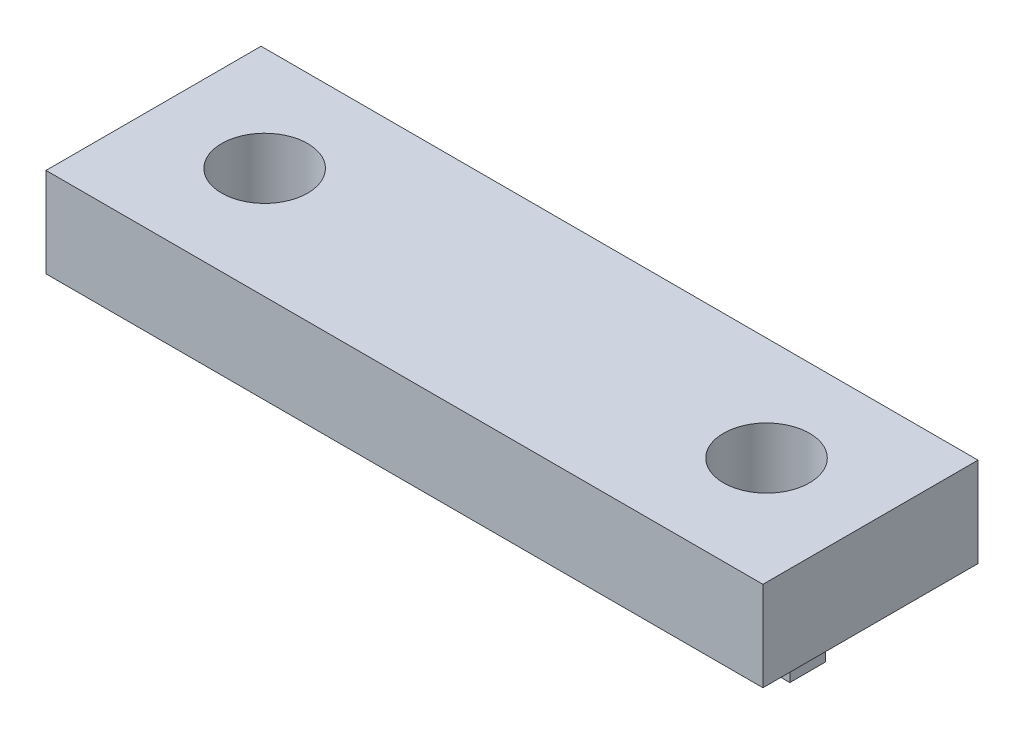
ISO-10303-21;
HEADER;
FILE_DESCRIPTION(('STEP AP214'),'2;1');
FILE_NAME('part.step','',(''),(''),'','','');
FILE_SCHEMA(('AUTOMOTIVE_DESIGN { 1 0 10303 214 1 1 1 1 }'));
ENDSEC;
DATA;
#1=APPLICATION_CONTEXT('core data for automotive mechanical design processes');
#2=APPLICATION_PROTOCOL_DEFINITION('international standard','automotive_design',2000,#1);
#3=PRODUCT_CONTEXT('',#1,'mechanical');
#4=PRODUCT('Part','Part','',(#3));
#5=PRODUCT_RELATED_PRODUCT_CATEGORY('part','',(#4));
#6=PRODUCT_DEFINITION_FORMATION('','',#4);
#7=PRODUCT_DEFINITION_CONTEXT('part definition',#1,'design');
#8=PRODUCT_DEFINITION('design','',#6,#7);
#9=PRODUCT_DEFINITION_SHAPE('','',#8);
#10=(LENGTH_UNIT() NAMED_UNIT(*) SI_UNIT(.MILLI.,.METRE.));
#11=(NAMED_UNIT(*) PLANE_ANGLE_UNIT() SI_UNIT($,.RADIAN.));
#12=(NAMED_UNIT(*) SI_UNIT($,.STERADIAN.) SOLID_ANGLE_UNIT());
#13=UNCERTAINTY_MEASURE_WITH_UNIT(LENGTH_MEASURE(1.E-05),#10,'distance_accuracy_value','');
#14=(GEOMETRIC_REPRESENTATION_CONTEXT(3) GLOBAL_UNCERTAINTY_ASSIGNED_CONTEXT((#13)) GLOBAL_UNIT_ASSIGNED_CONTEXT((#10,
#11,#12)) REPRESENTATION_CONTEXT('',''));
#15=CARTESIAN_POINT('',(0.,0.,0.));
#16=DIRECTION('',(0.,0.,1.));
#17=DIRECTION('',(1.,0.,0.));
#18=AXIS2_PLACEMENT_3D('',#15,#16,#17);
#19=CARTESIAN_POINT('',(40.,0.,2.));
#20=DIRECTION('',(0.,1.,0.));
#21=DIRECTION('',(0.,0.,1.));
#22=AXIS2_PLACEMENT_3D('',#19,#20,#21);
#23=PLANE('',#22);
#24=DIRECTION('',(-1.,0.,0.));
#25=VECTOR('',#24,1.);
#26=CARTESIAN_POINT('',(40.,0.,0.));
#27=LINE('',#26,#25);
#28=CARTESIAN_POINT('',(31.5,0.,0.));
#29=VERTEX_POINT('',#28);
#30=CARTESIAN_POINT('',(8.5,0.,0.));
#31=VERTEX_POINT('',#30);
#32=EDGE_CURVE('E11',#29,#31,#27,.T.);
#33=ORIENTED_EDGE('',*,*,#32,.F.);
#34=DIRECTION('',(0.,0.,1.));
#35=VECTOR('',#34,1.);
#36=CARTESIAN_POINT('',(31.5,0.,-38.));
#37=LINE('',#36,#35);
#38=CARTESIAN_POINT('',(31.5,0.,2.));
#39=VERTEX_POINT('',#38);
#40=EDGE_CURVE('E114',#29,#39,#37,.T.);
#41=ORIENTED_EDGE('',*,*,#40,.T.);
#42=DIRECTION('',(-1.,0.,0.));
#43=VECTOR('',#42,1.);
#44=CARTESIAN_POINT('',(40.,0.,2.));
#45=LINE('',#44,#43);
#46=CARTESIAN_POINT('',(8.5,0.,2.));
#47=VERTEX_POINT('',#46);
#48=EDGE_CURVE('E122',#39,#47,#45,.T.);
#49=ORIENTED_EDGE('',*,*,#48,.T.);
#50=DIRECTION('',(0.,0.,1.));
#51=VECTOR('',#50,1.);
#52=CARTESIAN_POINT('',(8.5,0.,-38.));
#53=LINE('',#52,#51);
#54=EDGE_CURVE('E203',#31,#47,#53,.T.);
#55=ORIENTED_EDGE('',*,*,#54,.F.);
#56=EDGE_LOOP('',(#33,#41,#49,#55));
#57=FACE_BOUND('',#56,.T.);
#58=ADVANCED_FACE('F33',(#57),#23,.F.);
#59=CARTESIAN_POINT('',(40.,0.,0.));
#60=DIRECTION('',(0.,0.,1.));
#61=DIRECTION('',(1.,0.,0.));
#62=AXIS2_PLACEMENT_3D('',#59,#60,#61);
#63=PLANE('',#62);
#64=CARTESIAN_POINT('',(13.5,5.,0.));
#65=DIRECTION('',(0.,0.,1.));
#66=DIRECTION('',(1.,0.,0.));
#67=AXIS2_PLACEMENT_3D('',#64,#65,#66);
#68=CIRCLE('',#67,2.49999999999999);
#69=CARTESIAN_POINT('',(16.,5.,0.));
#70=VERTEX_POINT('',#69);
#71=EDGE_CURVE('E219',#70,#70,#68,.T.);
#72=ORIENTED_EDGE('',*,*,#71,.T.);
#73=EDGE_LOOP('',(#72));
#74=FACE_BOUND('',#73,.T.);
#75=CARTESIAN_POINT('',(26.5,5.,0.));
#76=DIRECTION('',(0.,0.,1.));
#77=DIRECTION('',(1.,0.,0.));
#78=AXIS2_PLACEMENT_3D('',#75,#76,#77);
#79=CIRCLE('',#78,2.5);
#80=CARTESIAN_POINT('',(29.,5.,0.));
#81=VERTEX_POINT('',#80);
#82=EDGE_CURVE('E123',#81,#81,#79,.T.);
#83=ORIENTED_EDGE('',*,*,#82,.T.);
#84=EDGE_LOOP('',(#83));
#85=FACE_BOUND('',#84,.T.);
#86=DIRECTION('',(-1.,0.,0.));
#87=VECTOR('',#86,1.);
#88=CARTESIAN_POINT('',(40.,9.,0.));
#89=LINE('',#88,#87);
#90=CARTESIAN_POINT('',(40.,9.,0.));
#91=VERTEX_POINT('',#90);
#92=CARTESIAN_POINT('',(31.5,9.,0.));
#93=VERTEX_POINT('',#92);
#94=EDGE_CURVE('E180',#91,#93,#89,.T.);
#95=ORIENTED_EDGE('',*,*,#94,.T.);
#96=DIRECTION('',(0.,-1.,0.));
#97=VECTOR('',#96,1.);
#98=CARTESIAN_POINT('',(31.5,0.,0.));
#99=LINE('',#98,#97);
#100=EDGE_CURVE('E110',#93,#29,#99,.T.);
#101=ORIENTED_EDGE('',*,*,#100,.T.);
#102=ORIENTED_EDGE('',*,*,#32,.T.);
#103=DIRECTION('',(0.,1.,0.));
#104=VECTOR('',#103,1.);
#105=CARTESIAN_POINT('',(8.5,0.,0.));
#106=LINE('',#105,#104);
#107=CARTESIAN_POINT('',(8.5,9.,0.));
#108=VERTEX_POINT('',#107);
#109=EDGE_CURVE('E171',#31,#108,#106,.T.);
#110=ORIENTED_EDGE('',*,*,#109,.T.);
#111=DIRECTION('',(-1.,0.,0.));
#112=VECTOR('',#111,1.);
#113=CARTESIAN_POINT('',(40.,9.,0.));
#114=LINE('',#113,#112);
#115=CARTESIAN_POINT('',(0.,9.,0.));
#116=VERTEX_POINT('',#115);
#117=EDGE_CURVE('E164',#108,#116,#114,.T.);
#118=ORIENTED_EDGE('',*,*,#117,.T.);
#119=DIRECTION('',(0.,1.,0.));
#120=VECTOR('',#119,1.);
#121=CARTESIAN_POINT('',(0.,0.,0.));
#122=LINE('',#121,#120);
#123=CARTESIAN_POINT('',(0.,14.,0.));
#124=VERTEX_POINT('',#123);
#125=EDGE_CURVE('E140',#116,#124,#122,.T.);
#126=ORIENTED_EDGE('',*,*,#125,.T.);
#127=DIRECTION('',(-1.,0.,0.));
#128=VECTOR('',#127,1.);
#129=CARTESIAN_POINT('',(40.,14.,0.));
#130=LINE('',#129,#128);
#131=CARTESIAN_POINT('',(40.,14.,0.));
#132=VERTEX_POINT('',#131);
#133=EDGE_CURVE('E41',#132,#124,#130,.T.);
#134=ORIENTED_EDGE('',*,*,#133,.F.);
#135=DIRECTION('',(0.,1.,0.));
#136=VECTOR('',#135,1.);
#137=CARTESIAN_POINT('',(40.,0.,0.));
#138=LINE('',#137,#136);
#139=EDGE_CURVE('E75',#91,#132,#138,.T.);
#140=ORIENTED_EDGE('',*,*,#139,.F.);
#141=EDGE_LOOP('',(#95,#101,#102,#110,#118,#126,#134,#140));
#142=FACE_BOUND('',#141,.T.);
#143=ADVANCED_FACE('F169',(#74,#85,#142),#63,.F.);
#144=CARTESIAN_POINT('',(40.,14.,0.));
#145=DIRECTION('',(0.,-1.,0.));
#146=DIRECTION('',(0.,0.,-1.));
#147=AXIS2_PLACEMENT_3D('',#144,#145,#146);
#148=PLANE('',#147);
#149=CARTESIAN_POINT('',(6.,14.,5.8));
#150=DIRECTION('',(0.,1.,0.));
#151=DIRECTION('',(0.,0.,1.));
#152=AXIS2_PLACEMENT_3D('',#149,#150,#151);
#153=CIRCLE('',#152,2.4);
#154=CARTESIAN_POINT('',(6.,14.,8.2));
#155=VERTEX_POINT('',#154);
#156=EDGE_CURVE('E151',#155,#155,#153,.T.);
#157=ORIENTED_EDGE('',*,*,#156,.F.);
#158=EDGE_LOOP('',(#157));
#159=FACE_BOUND('',#158,.T.);
#160=CARTESIAN_POINT('',(34.,14.,5.8));
#161=DIRECTION('',(0.,1.,0.));
#162=DIRECTION('',(0.,0.,1.));
#163=AXIS2_PLACEMENT_3D('',#160,#161,#162);
#164=CIRCLE('',#163,2.4);
#165=CARTESIAN_POINT('',(34.,14.,8.2));
#166=VERTEX_POINT('',#165);
#167=EDGE_CURVE('E141',#166,#166,#164,.T.);
#168=ORIENTED_EDGE('',*,*,#167,.F.);
#169=EDGE_LOOP('',(#168));
#170=FACE_BOUND('',#169,.T.);
#171=DIRECTION('',(0.,0.,1.));
#172=VECTOR('',#171,1.);
#173=CARTESIAN_POINT('',(0.,14.,0.));
#174=LINE('',#173,#172);
#175=CARTESIAN_POINT('',(0.,14.,12.));
#176=VERTEX_POINT('',#175);
#177=EDGE_CURVE('E144',#124,#176,#174,.T.);
#178=ORIENTED_EDGE('',*,*,#177,.T.);
#179=DIRECTION('',(-1.,0.,0.));
#180=VECTOR('',#179,1.);
#181=CARTESIAN_POINT('',(40.,14.,12.));
#182=LINE('',#181,#180);
#183=CARTESIAN_POINT('',(40.,14.,12.));
#184=VERTEX_POINT('',#183);
#185=EDGE_CURVE('E131',#184,#176,#182,.T.);
#186=ORIENTED_EDGE('',*,*,#185,.F.);
#187=DIRECTION('',(0.,0.,1.));
#188=VECTOR('',#187,1.);
#189=CARTESIAN_POINT('',(40.,14.,0.));
#190=LINE('',#189,#188);
#191=EDGE_CURVE('E156',#132,#184,#190,.T.);
#192=ORIENTED_EDGE('',*,*,#191,.F.);
#193=ORIENTED_EDGE('',*,*,#133,.T.);
#194=EDGE_LOOP('',(#178,#186,#192,#193));
#195=FACE_BOUND('',#194,.T.);
#196=ADVANCED_FACE('F177',(#159,#170,#195),#148,.F.);
#197=CARTESIAN_POINT('',(40.,14.,12.));
#198=DIRECTION('',(0.,0.,-1.));
#199=DIRECTION('',(0.,1.,0.));
#200=AXIS2_PLACEMENT_3D('',#197,#198,#199);
#201=PLANE('',#200);
#202=DIRECTION('',(0.,-1.,0.));
#203=VECTOR('',#202,1.);
#204=CARTESIAN_POINT('',(0.,14.,12.));
#205=LINE('',#204,#203);
#206=CARTESIAN_POINT('',(0.,9.,12.));
#207=VERTEX_POINT('',#206);
#208=EDGE_CURVE('E72',#176,#207,#205,.T.);
#209=ORIENTED_EDGE('',*,*,#208,.T.);
#210=DIRECTION('',(-1.,0.,0.));
#211=VECTOR('',#210,1.);
#212=CARTESIAN_POINT('',(40.,9.,12.));
#213=LINE('',#212,#211);
#214=CARTESIAN_POINT('',(40.,9.,12.));
#215=VERTEX_POINT('',#214);
#216=EDGE_CURVE('E129',#215,#207,#213,.T.);
#217=ORIENTED_EDGE('',*,*,#216,.F.);
#218=DIRECTION('',(0.,-1.,0.));
#219=VECTOR('',#218,1.);
#220=CARTESIAN_POINT('',(40.,14.,12.));
#221=LINE('',#220,#219);
#222=EDGE_CURVE('E55',#184,#215,#221,.T.);
#223=ORIENTED_EDGE('',*,*,#222,.F.);
#224=ORIENTED_EDGE('',*,*,#185,.T.);
#225=EDGE_LOOP('',(#209,#217,#223,#224));
#226=FACE_BOUND('',#225,.T.);
#227=ADVANCED_FACE('F179',(#226),#201,.F.);
#228=CARTESIAN_POINT('',(40.,9.,12.));
#229=DIRECTION('',(0.,1.,0.));
#230=DIRECTION('',(0.,0.,1.));
#231=AXIS2_PLACEMENT_3D('',#228,#229,#230);
#232=PLANE('',#231);
#233=CARTESIAN_POINT('',(6.,9.,5.8));
#234=DIRECTION('',(0.,1.,0.));
#235=DIRECTION('',(0.,0.,1.));
#236=AXIS2_PLACEMENT_3D('',#233,#234,#235);
#237=CIRCLE('',#236,2.4);
#238=CARTESIAN_POINT('',(6.,9.,8.2));
#239=VERTEX_POINT('',#238);
#240=EDGE_CURVE('E36',#239,#239,#237,.T.);
#241=ORIENTED_EDGE('',*,*,#240,.T.);
#242=EDGE_LOOP('',(#241));
#243=FACE_BOUND('',#242,.T.);
#244=CARTESIAN_POINT('',(34.,9.,5.8));
#245=DIRECTION('',(0.,1.,0.));
#246=DIRECTION('',(0.,0.,1.));
#247=AXIS2_PLACEMENT_3D('',#244,#245,#246);
#248=CIRCLE('',#247,2.4);
#249=CARTESIAN_POINT('',(34.,9.,8.2));
#250=VERTEX_POINT('',#249);
#251=EDGE_CURVE('E138',#250,#250,#248,.T.);
#252=ORIENTED_EDGE('',*,*,#251,.T.);
#253=EDGE_LOOP('',(#252));
#254=FACE_BOUND('',#253,.T.);
#255=DIRECTION('',(0.,0.,-1.));
#256=VECTOR('',#255,1.);
#257=CARTESIAN_POINT('',(0.,9.,12.));
#258=LINE('',#257,#256);
#259=EDGE_CURVE('E157',#207,#116,#258,.T.);
#260=ORIENTED_EDGE('',*,*,#259,.T.);
#261=ORIENTED_EDGE('',*,*,#117,.F.);
#262=DIRECTION('',(0.,0.,1.));
#263=VECTOR('',#262,1.);
#264=CARTESIAN_POINT('',(8.5,9.,-38.));
#265=LINE('',#264,#263);
#266=CARTESIAN_POINT('',(8.5,9.,2.));
#267=VERTEX_POINT('',#266);
#268=EDGE_CURVE('E127',#108,#267,#265,.T.);
#269=ORIENTED_EDGE('',*,*,#268,.T.);
#270=DIRECTION('',(-1.,0.,0.));
#271=VECTOR('',#270,1.);
#272=CARTESIAN_POINT('',(40.,9.,2.));
#273=LINE('',#272,#271);
#274=CARTESIAN_POINT('',(31.5,9.,2.));
#275=VERTEX_POINT('',#274);
#276=EDGE_CURVE('E120',#275,#267,#273,.T.);
#277=ORIENTED_EDGE('',*,*,#276,.F.);
#278=DIRECTION('',(0.,0.,1.));
#279=VECTOR('',#278,1.);
#280=CARTESIAN_POINT('',(31.5,9.,-38.));
#281=LINE('',#280,#279);
#282=EDGE_CURVE('E104',#93,#275,#281,.T.);
#283=ORIENTED_EDGE('',*,*,#282,.F.);
#284=ORIENTED_EDGE('',*,*,#94,.F.);
#285=DIRECTION('',(0.,0.,-1.));
#286=VECTOR('',#285,1.);
#287=CARTESIAN_POINT('',(40.,9.,12.));
#288=LINE('',#287,#286);
#289=EDGE_CURVE('E49',#215,#91,#288,.T.);
#290=ORIENTED_EDGE('',*,*,#289,.F.);
#291=ORIENTED_EDGE('',*,*,#216,.T.);
#292=EDGE_LOOP('',(#260,#261,#269,#277,#283,#284,#290,#291));
#293=FACE_BOUND('',#292,.T.);
#294=ADVANCED_FACE('F125',(#243,#254,#293),#232,.F.);
#295=CARTESIAN_POINT('',(40.,9.,2.));
#296=DIRECTION('',(0.,0.,-1.));
#297=DIRECTION('',(-1.,0.,0.));
#298=AXIS2_PLACEMENT_3D('',#295,#296,#297);
#299=PLANE('',#298);
#300=CARTESIAN_POINT('',(13.5,5.,2.));
#301=DIRECTION('',(0.,0.,1.));
#302=DIRECTION('',(1.,0.,0.));
#303=AXIS2_PLACEMENT_3D('',#300,#301,#302);
#304=CIRCLE('',#303,2.49999999999999);
#305=CARTESIAN_POINT('',(16.,5.,2.));
#306=VERTEX_POINT('',#305);
#307=EDGE_CURVE('E222',#306,#306,#304,.T.);
#308=ORIENTED_EDGE('',*,*,#307,.F.);
#309=EDGE_LOOP('',(#308));
#310=FACE_BOUND('',#309,.T.);
#311=CARTESIAN_POINT('',(26.5,5.,2.));
#312=DIRECTION('',(0.,0.,1.));
#313=DIRECTION('',(1.,0.,0.));
#314=AXIS2_PLACEMENT_3D('',#311,#312,#313);
#315=CIRCLE('',#314,2.5);
#316=CARTESIAN_POINT('',(29.,5.,2.));
#317=VERTEX_POINT('',#316);
#318=EDGE_CURVE('E216',#317,#317,#315,.T.);
#319=ORIENTED_EDGE('',*,*,#318,.F.);
#320=EDGE_LOOP('',(#319));
#321=FACE_BOUND('',#320,.T.);
#322=ORIENTED_EDGE('',*,*,#48,.F.);
#323=DIRECTION('',(0.,-1.,0.));
#324=VECTOR('',#323,1.);
#325=CARTESIAN_POINT('',(31.5,0.,2.));
#326=LINE('',#325,#324);
#327=EDGE_CURVE('E107',#275,#39,#326,.T.);
#328=ORIENTED_EDGE('',*,*,#327,.F.);
#329=ORIENTED_EDGE('',*,*,#276,.T.);
#330=DIRECTION('',(0.,1.,0.));
#331=VECTOR('',#330,1.);
#332=CARTESIAN_POINT('',(8.5,0.,2.));
#333=LINE('',#332,#331);
#334=EDGE_CURVE('E209',#47,#267,#333,.T.);
#335=ORIENTED_EDGE('',*,*,#334,.F.);
#336=EDGE_LOOP('',(#322,#328,#329,#335));
#337=FACE_BOUND('',#336,.T.);
#338=ADVANCED_FACE('F118',(#310,#321,#337),#299,.F.);
#339=CARTESIAN_POINT('',(40.,0.,0.));
#340=DIRECTION('',(1.,0.,0.));
#341=DIRECTION('',(0.,0.,-1.));
#342=AXIS2_PLACEMENT_3D('',#339,#340,#341);
#343=PLANE('',#342);
#344=ORIENTED_EDGE('',*,*,#289,.T.);
#345=ORIENTED_EDGE('',*,*,#139,.T.);
#346=ORIENTED_EDGE('',*,*,#191,.T.);
#347=ORIENTED_EDGE('',*,*,#222,.T.);
#348=EDGE_LOOP('',(#344,#345,#346,#347));
#349=FACE_BOUND('',#348,.T.);
#350=ADVANCED_FACE('F182',(#349),#343,.T.);
#351=CARTESIAN_POINT('',(0.,0.,0.));
#352=DIRECTION('',(1.,0.,0.));
#353=DIRECTION('',(0.,0.,-1.));
#354=AXIS2_PLACEMENT_3D('',#351,#352,#353);
#355=PLANE('',#354);
#356=ORIENTED_EDGE('',*,*,#125,.F.);
#357=ORIENTED_EDGE('',*,*,#259,.F.);
#358=ORIENTED_EDGE('',*,*,#208,.F.);
#359=ORIENTED_EDGE('',*,*,#177,.F.);
#360=EDGE_LOOP('',(#356,#357,#358,#359));
#361=FACE_BOUND('',#360,.T.);
#362=ADVANCED_FACE('F174',(#361),#355,.F.);
#363=CARTESIAN_POINT('',(34.,-26.,5.79999999999999));
#364=DIRECTION('',(0.,1.,0.));
#365=DIRECTION('',(0.,0.,1.));
#366=AXIS2_PLACEMENT_3D('',#363,#364,#365);
#367=CYLINDRICAL_SURFACE('',#366,2.4);
#368=ORIENTED_EDGE('',*,*,#167,.T.);
#369=EDGE_LOOP('',(#368));
#370=FACE_BOUND('',#369,.T.);
#371=ORIENTED_EDGE('',*,*,#251,.F.);
#372=EDGE_LOOP('',(#371));
#373=FACE_BOUND('',#372,.T.);
#374=ADVANCED_FACE('F189',(#370,#373),#367,.F.);
#375=CARTESIAN_POINT('',(6.,-26.,5.79999999999999));
#376=DIRECTION('',(0.,1.,0.));
#377=DIRECTION('',(0.,0.,1.));
#378=AXIS2_PLACEMENT_3D('',#375,#376,#377);
#379=CYLINDRICAL_SURFACE('',#378,2.4);
#380=ORIENTED_EDGE('',*,*,#156,.T.);
#381=EDGE_LOOP('',(#380));
#382=FACE_BOUND('',#381,.T.);
#383=ORIENTED_EDGE('',*,*,#240,.F.);
#384=EDGE_LOOP('',(#383));
#385=FACE_BOUND('',#384,.T.);
#386=ADVANCED_FACE('F246',(#382,#385),#379,.F.);
#387=CARTESIAN_POINT('',(8.5,0.,-38.));
#388=DIRECTION('',(1.,0.,0.));
#389=DIRECTION('',(0.,0.,-1.));
#390=AXIS2_PLACEMENT_3D('',#387,#388,#389);
#391=PLANE('',#390);
#392=ORIENTED_EDGE('',*,*,#54,.T.);
#393=ORIENTED_EDGE('',*,*,#334,.T.);
#394=ORIENTED_EDGE('',*,*,#268,.F.);
#395=ORIENTED_EDGE('',*,*,#109,.F.);
#396=EDGE_LOOP('',(#392,#393,#394,#395));
#397=FACE_BOUND('',#396,.T.);
#398=ADVANCED_FACE('F205',(#397),#391,.F.);
#399=CARTESIAN_POINT('',(31.5,0.,-38.));
#400=DIRECTION('',(-1.,0.,0.));
#401=DIRECTION('',(0.,0.,1.));
#402=AXIS2_PLACEMENT_3D('',#399,#400,#401);
#403=PLANE('',#402);
#404=ORIENTED_EDGE('',*,*,#282,.T.);
#405=ORIENTED_EDGE('',*,*,#327,.T.);
#406=ORIENTED_EDGE('',*,*,#40,.F.);
#407=ORIENTED_EDGE('',*,*,#100,.F.);
#408=EDGE_LOOP('',(#404,#405,#406,#407));
#409=FACE_BOUND('',#408,.T.);
#410=ADVANCED_FACE('F106',(#409),#403,.F.);
#411=CARTESIAN_POINT('',(26.5,5.,-38.));
#412=DIRECTION('',(0.,0.,1.));
#413=DIRECTION('',(1.,0.,0.));
#414=AXIS2_PLACEMENT_3D('',#411,#412,#413);
#415=CYLINDRICAL_SURFACE('',#414,2.5);
#416=ORIENTED_EDGE('',*,*,#318,.T.);
#417=EDGE_LOOP('',(#416));
#418=FACE_BOUND('',#417,.T.);
#419=ORIENTED_EDGE('',*,*,#82,.F.);
#420=EDGE_LOOP('',(#419));
#421=FACE_BOUND('',#420,.T.);
#422=ADVANCED_FACE('F231',(#418,#421),#415,.F.);
#423=CARTESIAN_POINT('',(13.5,5.,-38.));
#424=DIRECTION('',(0.,0.,1.));
#425=DIRECTION('',(1.,0.,0.));
#426=AXIS2_PLACEMENT_3D('',#423,#424,#425);
#427=CYLINDRICAL_SURFACE('',#426,2.49999999999999);
#428=ORIENTED_EDGE('',*,*,#307,.T.);
#429=EDGE_LOOP('',(#428));
#430=FACE_BOUND('',#429,.T.);
#431=ORIENTED_EDGE('',*,*,#71,.F.);
#432=EDGE_LOOP('',(#431));
#433=FACE_BOUND('',#432,.T.);
#434=ADVANCED_FACE('F226',(#430,#433),#427,.F.);
#435=CLOSED_SHELL('',(#58,#143,#196,#227,#294,#338,#350,#362,#374,#386,#398,#410,#422,#434));
#436=MANIFOLD_SOLID_BREP('B2',#435);
#437=ADVANCED_BREP_SHAPE_REPRESENTATION('',(#18,#436),#14);
#438=SHAPE_DEFINITION_REPRESENTATION(#9,#437);
ENDSEC;
END-ISO-10303-21;
